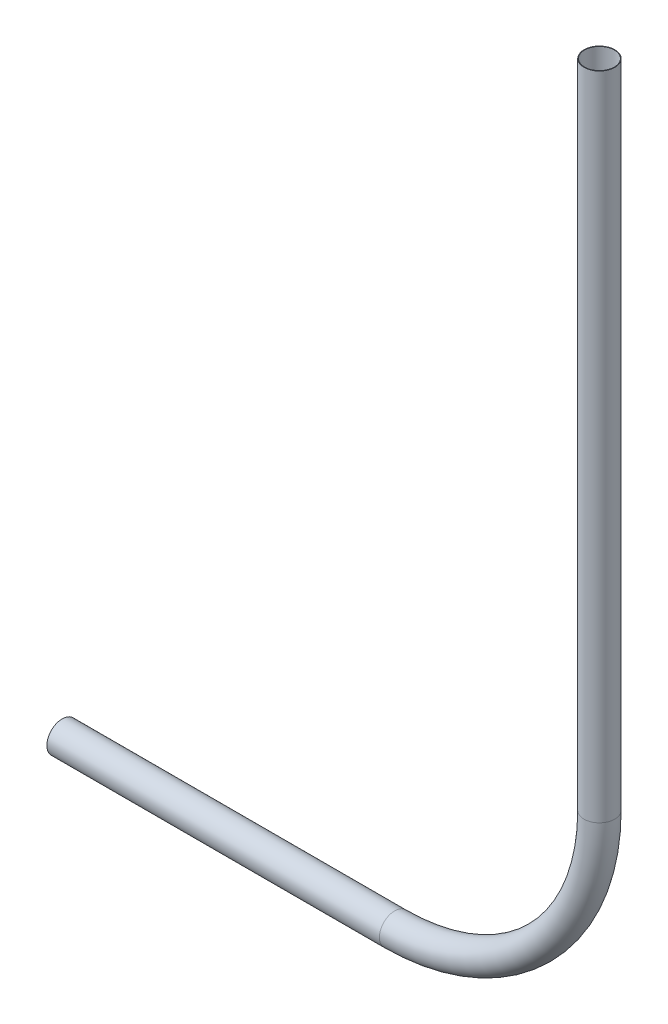
ISO-10303-21;
HEADER;
FILE_DESCRIPTION(('STEP AP214'),'2;1');
FILE_NAME('part.step','',(''),(''),'','','');
FILE_SCHEMA(('AUTOMOTIVE_DESIGN { 1 0 10303 214 1 1 1 1 }'));
ENDSEC;
DATA;
#1=APPLICATION_CONTEXT('core data for automotive mechanical design processes');
#2=APPLICATION_PROTOCOL_DEFINITION('international standard','automotive_design',2000,#1);
#3=PRODUCT_CONTEXT('',#1,'mechanical');
#4=PRODUCT('Part','Part','',(#3));
#5=PRODUCT_RELATED_PRODUCT_CATEGORY('part','',(#4));
#6=PRODUCT_DEFINITION_FORMATION('','',#4);
#7=PRODUCT_DEFINITION_CONTEXT('part definition',#1,'design');
#8=PRODUCT_DEFINITION('design','',#6,#7);
#9=PRODUCT_DEFINITION_SHAPE('','',#8);
#10=(LENGTH_UNIT() NAMED_UNIT(*) SI_UNIT(.MILLI.,.METRE.));
#11=(NAMED_UNIT(*) PLANE_ANGLE_UNIT() SI_UNIT($,.RADIAN.));
#12=(NAMED_UNIT(*) SI_UNIT($,.STERADIAN.) SOLID_ANGLE_UNIT());
#13=UNCERTAINTY_MEASURE_WITH_UNIT(LENGTH_MEASURE(1.E-05),#10,'distance_accuracy_value','');
#14=(GEOMETRIC_REPRESENTATION_CONTEXT(3) GLOBAL_UNCERTAINTY_ASSIGNED_CONTEXT((#13)) GLOBAL_UNIT_ASSIGNED_CONTEXT((#10,
#11,#12)) REPRESENTATION_CONTEXT('',''));
#15=CARTESIAN_POINT('',(0.,0.,0.));
#16=DIRECTION('',(0.,0.,1.));
#17=DIRECTION('',(1.,0.,0.));
#18=AXIS2_PLACEMENT_3D('',#15,#16,#17);
#19=CARTESIAN_POINT('',(-22963.5408202663,-7934.10964775341,40217.8019477493));
#20=DIRECTION('',(-1.,0.,0.));
#21=DIRECTION('',(0.,0.,-1.));
#22=AXIS2_PLACEMENT_3D('',#19,#20,#21);
#23=PLANE('',#22);
#24=CARTESIAN_POINT('',(-22963.5408202663,-7934.10964775341,40217.8019477493));
#25=DIRECTION('',(-1.,0.,0.));
#26=DIRECTION('',(0.,0.,1.));
#27=AXIS2_PLACEMENT_3D('',#24,#25,#26);
#28=CIRCLE('',#27,29.0000000000011);
#29=CARTESIAN_POINT('',(-22963.5408202663,-7934.10964775341,40246.8019477493));
#30=VERTEX_POINT('',#29);
#31=EDGE_CURVE('E72',#30,#30,#28,.T.);
#32=ORIENTED_EDGE('',*,*,#31,.F.);
#33=EDGE_LOOP('',(#32));
#34=FACE_BOUND('',#33,.T.);
#35=CARTESIAN_POINT('',(-22963.5408202663,-7934.10964775341,40217.8019477493));
#36=DIRECTION('',(-1.,0.,0.));
#37=DIRECTION('',(0.,0.,-1.));
#38=AXIS2_PLACEMENT_3D('',#35,#36,#37);
#39=CIRCLE('',#38,30.0000000000011);
#40=CARTESIAN_POINT('',(-22963.5408202663,-7934.10964775341,40187.8019477493));
#41=VERTEX_POINT('',#40);
#42=EDGE_CURVE('E63',#41,#41,#39,.T.);
#43=ORIENTED_EDGE('',*,*,#42,.T.);
#44=EDGE_LOOP('',(#43));
#45=FACE_BOUND('',#44,.T.);
#46=ADVANCED_FACE('F49',(#34,#45),#23,.T.);
#47=CARTESIAN_POINT('',(-21913.7890243184,-6261.81040257031,40217.8019477493));
#48=DIRECTION('',(0.,-1.,0.));
#49=DIRECTION('',(0.,0.,-1.));
#50=AXIS2_PLACEMENT_3D('',#47,#48,#49);
#51=PLANE('',#50);
#52=CARTESIAN_POINT('',(-21913.7890243184,-6261.81040257031,40217.8019477493));
#53=DIRECTION('',(0.,-1.,0.));
#54=DIRECTION('',(0.,0.,-1.));
#55=AXIS2_PLACEMENT_3D('',#52,#53,#54);
#56=CIRCLE('',#55,29.0000000000011);
#57=CARTESIAN_POINT('',(-21913.7890243184,-6261.81040257031,40188.8019477493));
#58=VERTEX_POINT('',#57);
#59=EDGE_CURVE('E68',#58,#58,#56,.T.);
#60=ORIENTED_EDGE('',*,*,#59,.T.);
#61=EDGE_LOOP('',(#60));
#62=FACE_BOUND('',#61,.T.);
#63=CARTESIAN_POINT('',(-21913.7890243184,-6261.81040257031,40217.8019477493));
#64=DIRECTION('',(0.,-1.,0.));
#65=DIRECTION('',(0.,0.,-1.));
#66=AXIS2_PLACEMENT_3D('',#63,#64,#65);
#67=CIRCLE('',#66,30.0000000000011);
#68=CARTESIAN_POINT('',(-21913.7890243184,-6261.81040257031,40187.8019477493));
#69=VERTEX_POINT('',#68);
#70=EDGE_CURVE('E11',#69,#69,#67,.T.);
#71=ORIENTED_EDGE('',*,*,#70,.F.);
#72=EDGE_LOOP('',(#71));
#73=FACE_BOUND('',#72,.T.);
#74=ADVANCED_FACE('F92',(#62,#73),#51,.F.);
#75=CARTESIAN_POINT('',(-22963.5408202663,-7934.10964775341,40217.8019477493));
#76=DIRECTION('',(1.,0.,0.));
#77=DIRECTION('',(0.,0.,-1.));
#78=AXIS2_PLACEMENT_3D('',#75,#76,#77);
#79=CYLINDRICAL_SURFACE('',#78,30.0000000000011);
#80=CARTESIAN_POINT('',(-22313.7890243184,-7934.10964775341,40217.8019477493));
#81=DIRECTION('',(-1.,0.,0.));
#82=DIRECTION('',(0.,0.,-1.));
#83=AXIS2_PLACEMENT_3D('',#80,#81,#82);
#84=CIRCLE('',#83,30.0000000000011);
#85=CARTESIAN_POINT('',(-22313.7890243184,-7964.10964775341,40217.8019477493));
#86=VERTEX_POINT('',#85);
#87=EDGE_CURVE('E59',#86,#86,#84,.T.);
#88=ORIENTED_EDGE('',*,*,#87,.T.);
#89=EDGE_LOOP('',(#88));
#90=FACE_BOUND('',#89,.T.);
#91=ORIENTED_EDGE('',*,*,#42,.F.);
#92=EDGE_LOOP('',(#91));
#93=FACE_BOUND('',#92,.T.);
#94=ADVANCED_FACE('F96',(#90,#93),#79,.T.);
#95=CARTESIAN_POINT('',(-22313.7890243184,-7534.10964775341,40217.8019477493));
#96=DIRECTION('',(0.,0.,1.));
#97=DIRECTION('',(1.,0.,0.));
#98=AXIS2_PLACEMENT_3D('',#95,#96,#97);
#99=TOROIDAL_SURFACE('',#98,399.999999999999,30.0000000000011);
#100=CARTESIAN_POINT('',(-21913.7890243184,-7534.10964775341,40217.8019477493));
#101=DIRECTION('',(0.,-1.,0.));
#102=DIRECTION('',(0.,0.,-1.));
#103=AXIS2_PLACEMENT_3D('',#100,#101,#102);
#104=CIRCLE('',#103,30.0000000000011);
#105=CARTESIAN_POINT('',(-21883.7890243184,-7534.10964775341,40217.8019477493));
#106=VERTEX_POINT('',#105);
#107=EDGE_CURVE('E55',#106,#106,#104,.T.);
#108=CARTESIAN_POINT('',(-22313.7890243184,-7534.10964775341,40217.8019477493));
#109=DIRECTION('',(0.,0.,1.));
#110=DIRECTION('',(1.,0.,0.));
#111=AXIS2_PLACEMENT_3D('',#108,#109,#110);
#112=CIRCLE('',#111,430.000000000001);
#113=EDGE_CURVE('',#86,#106,#112,.T.);
#114=ORIENTED_EDGE('',*,*,#87,.F.);
#115=ORIENTED_EDGE('',*,*,#107,.T.);
#116=ORIENTED_EDGE('',*,*,#113,.T.);
#117=ORIENTED_EDGE('',*,*,#113,.F.);
#118=EDGE_LOOP('',(#114,#116,#115,#117));
#119=FACE_BOUND('',#118,.T.);
#120=ADVANCED_FACE('F98',(#119),#99,.T.);
#121=CARTESIAN_POINT('',(-21913.7890243184,-7534.10964775341,40217.8019477493));
#122=DIRECTION('',(0.,1.,0.));
#123=DIRECTION('',(0.,0.,1.));
#124=AXIS2_PLACEMENT_3D('',#121,#122,#123);
#125=CYLINDRICAL_SURFACE('',#124,30.0000000000011);
#126=ORIENTED_EDGE('',*,*,#70,.T.);
#127=EDGE_LOOP('',(#126));
#128=FACE_BOUND('',#127,.T.);
#129=ORIENTED_EDGE('',*,*,#107,.F.);
#130=EDGE_LOOP('',(#129));
#131=FACE_BOUND('',#130,.T.);
#132=ADVANCED_FACE('F86',(#128,#131),#125,.T.);
#133=CARTESIAN_POINT('',(-22963.5408202663,-7934.10964775341,40217.8019477493));
#134=DIRECTION('',(1.,0.,0.));
#135=DIRECTION('',(0.,0.,-1.));
#136=AXIS2_PLACEMENT_3D('',#133,#134,#135);
#137=CYLINDRICAL_SURFACE('',#136,29.0000000000011);
#138=CARTESIAN_POINT('',(-22313.7890243184,-7934.10964775341,40217.8019477493));
#139=DIRECTION('',(1.,0.,0.));
#140=DIRECTION('',(0.,0.,-1.));
#141=AXIS2_PLACEMENT_3D('',#138,#139,#140);
#142=CIRCLE('',#141,29.0000000000011);
#143=CARTESIAN_POINT('',(-22313.7890243184,-7963.10964775341,40217.8019477493));
#144=VERTEX_POINT('',#143);
#145=EDGE_CURVE('E75',#144,#144,#142,.F.);
#146=ORIENTED_EDGE('',*,*,#145,.F.);
#147=EDGE_LOOP('',(#146));
#148=FACE_BOUND('',#147,.T.);
#149=ORIENTED_EDGE('',*,*,#31,.T.);
#150=EDGE_LOOP('',(#149));
#151=FACE_BOUND('',#150,.T.);
#152=ADVANCED_FACE('F83',(#148,#151),#137,.F.);
#153=CARTESIAN_POINT('',(-22313.7890243184,-7534.10964775341,40217.8019477493));
#154=DIRECTION('',(0.,0.,1.));
#155=DIRECTION('',(1.,0.,0.));
#156=AXIS2_PLACEMENT_3D('',#153,#154,#155);
#157=TOROIDAL_SURFACE('',#156,399.999999999999,29.0000000000011);
#158=CARTESIAN_POINT('',(-21913.7890243184,-7534.10964775341,40217.8019477493));
#159=DIRECTION('',(0.,-1.,0.));
#160=DIRECTION('',(0.,0.,-1.));
#161=AXIS2_PLACEMENT_3D('',#158,#159,#160);
#162=CIRCLE('',#161,29.0000000000011);
#163=CARTESIAN_POINT('',(-21884.7890243184,-7534.10964775341,40217.8019477493));
#164=VERTEX_POINT('',#163);
#165=EDGE_CURVE('E71',#164,#164,#162,.T.);
#166=CARTESIAN_POINT('',(-22313.7890243184,-7534.10964775341,40217.8019477493));
#167=DIRECTION('',(0.,0.,1.));
#168=DIRECTION('',(1.,0.,0.));
#169=AXIS2_PLACEMENT_3D('',#166,#167,#168);
#170=CIRCLE('',#169,429.000000000001);
#171=EDGE_CURVE('',#144,#164,#170,.T.);
#172=ORIENTED_EDGE('',*,*,#145,.T.);
#173=ORIENTED_EDGE('',*,*,#165,.F.);
#174=ORIENTED_EDGE('',*,*,#171,.T.);
#175=ORIENTED_EDGE('',*,*,#171,.F.);
#176=EDGE_LOOP('',(#172,#174,#173,#175));
#177=FACE_BOUND('',#176,.T.);
#178=ADVANCED_FACE('F81',(#177),#157,.F.);
#179=CARTESIAN_POINT('',(-21913.7890243184,-7534.10964775341,40217.8019477493));
#180=DIRECTION('',(0.,1.,0.));
#181=DIRECTION('',(0.,0.,1.));
#182=AXIS2_PLACEMENT_3D('',#179,#180,#181);
#183=CYLINDRICAL_SURFACE('',#182,29.0000000000011);
#184=ORIENTED_EDGE('',*,*,#59,.F.);
#185=EDGE_LOOP('',(#184));
#186=FACE_BOUND('',#185,.T.);
#187=ORIENTED_EDGE('',*,*,#165,.T.);
#188=EDGE_LOOP('',(#187));
#189=FACE_BOUND('',#188,.T.);
#190=ADVANCED_FACE('F93',(#186,#189),#183,.F.);
#191=CLOSED_SHELL('',(#46,#74,#94,#120,#132,#152,#178,#190));
#192=MANIFOLD_SOLID_BREP('B2',#191);
#193=ADVANCED_BREP_SHAPE_REPRESENTATION('',(#18,#192),#14);
#194=SHAPE_DEFINITION_REPRESENTATION(#9,#193);
ENDSEC;
END-ISO-10303-21;
